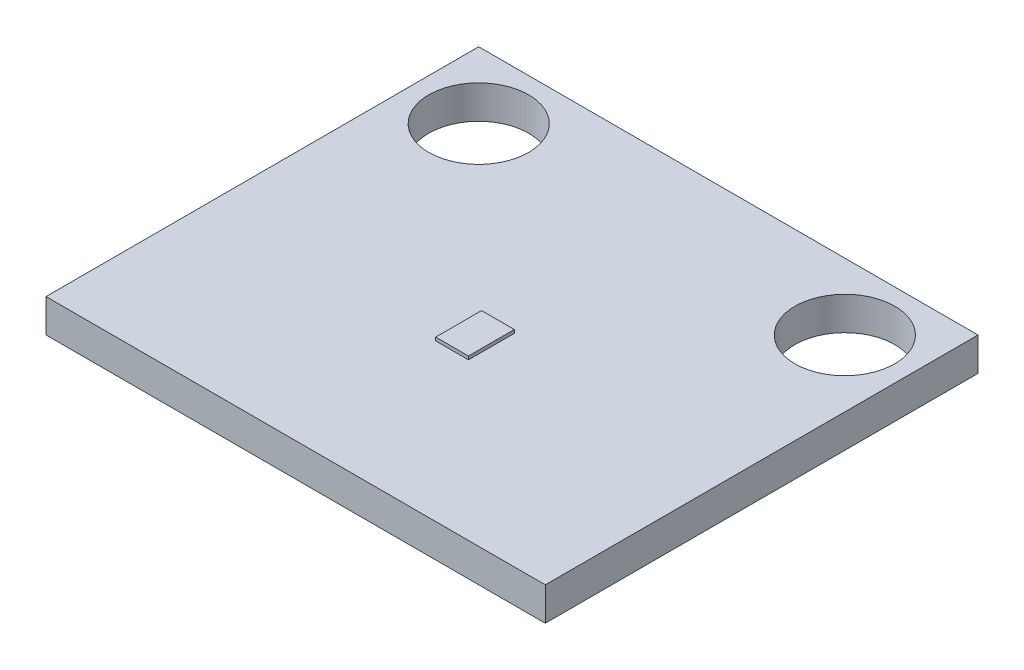
ISO-10303-21;
HEADER;
FILE_DESCRIPTION(('STEP AP214'),'2;1');
FILE_NAME('part.step','',(''),(''),'','','');
FILE_SCHEMA(('AUTOMOTIVE_DESIGN { 1 0 10303 214 1 1 1 1 }'));
ENDSEC;
DATA;
#1=APPLICATION_CONTEXT('core data for automotive mechanical design processes');
#2=APPLICATION_PROTOCOL_DEFINITION('international standard','automotive_design',2000,#1);
#3=PRODUCT_CONTEXT('',#1,'mechanical');
#4=PRODUCT('Part','Part','',(#3));
#5=PRODUCT_RELATED_PRODUCT_CATEGORY('part','',(#4));
#6=PRODUCT_DEFINITION_FORMATION('','',#4);
#7=PRODUCT_DEFINITION_CONTEXT('part definition',#1,'design');
#8=PRODUCT_DEFINITION('design','',#6,#7);
#9=PRODUCT_DEFINITION_SHAPE('','',#8);
#10=(LENGTH_UNIT() NAMED_UNIT(*) SI_UNIT(.MILLI.,.METRE.));
#11=(NAMED_UNIT(*) PLANE_ANGLE_UNIT() SI_UNIT($,.RADIAN.));
#12=(NAMED_UNIT(*) SI_UNIT($,.STERADIAN.) SOLID_ANGLE_UNIT());
#13=UNCERTAINTY_MEASURE_WITH_UNIT(LENGTH_MEASURE(1.E-05),#10,'distance_accuracy_value','');
#14=(GEOMETRIC_REPRESENTATION_CONTEXT(3) GLOBAL_UNCERTAINTY_ASSIGNED_CONTEXT((#13)) GLOBAL_UNIT_ASSIGNED_CONTEXT((#10,
#11,#12)) REPRESENTATION_CONTEXT('',''));
#15=CARTESIAN_POINT('',(0.,0.,0.));
#16=DIRECTION('',(0.,0.,1.));
#17=DIRECTION('',(1.,0.,0.));
#18=AXIS2_PLACEMENT_3D('',#15,#16,#17);
#19=CARTESIAN_POINT('',(0.,1.27,0.));
#20=DIRECTION('',(0.,-1.,0.));
#21=DIRECTION('',(0.,0.,-1.));
#22=AXIS2_PLACEMENT_3D('',#19,#20,#21);
#23=PLANE('',#22);
#24=DIRECTION('',(1.,0.,0.));
#25=VECTOR('',#24,1.);
#26=CARTESIAN_POINT('',(-7.64177142857143,1.27,-7.21722857142857));
#27=LINE('',#26,#25);
#28=CARTESIAN_POINT('',(-7.64177142857143,1.27,-7.21722857142857));
#29=VERTEX_POINT('',#28);
#30=CARTESIAN_POINT('',(11.4082285714286,1.27,-7.21722857142857));
#31=VERTEX_POINT('',#30);
#32=EDGE_CURVE('E141',#29,#31,#27,.T.);
#33=ORIENTED_EDGE('',*,*,#32,.F.);
#34=DIRECTION('',(0.,0.,1.));
#35=VECTOR('',#34,1.);
#36=CARTESIAN_POINT('',(-7.64177142857143,1.27,-7.21722857142857));
#37=LINE('',#36,#35);
#38=CARTESIAN_POINT('',(-7.64177142857143,1.27,9.29277142857143));
#39=VERTEX_POINT('',#38);
#40=EDGE_CURVE('E150',#29,#39,#37,.T.);
#41=ORIENTED_EDGE('',*,*,#40,.T.);
#42=DIRECTION('',(1.,0.,0.));
#43=VECTOR('',#42,1.);
#44=CARTESIAN_POINT('',(-7.64177142857143,1.27,9.29277142857143));
#45=LINE('',#44,#43);
#46=CARTESIAN_POINT('',(11.4082285714286,1.27,9.29277142857143));
#47=VERTEX_POINT('',#46);
#48=EDGE_CURVE('E148',#39,#47,#45,.T.);
#49=ORIENTED_EDGE('',*,*,#48,.T.);
#50=DIRECTION('',(0.,0.,1.));
#51=VECTOR('',#50,1.);
#52=CARTESIAN_POINT('',(11.4082285714286,1.27,-7.21722857142857));
#53=LINE('',#52,#51);
#54=EDGE_CURVE('E144',#31,#47,#53,.T.);
#55=ORIENTED_EDGE('',*,*,#54,.F.);
#56=EDGE_LOOP('',(#33,#41,#49,#55));
#57=FACE_BOUND('',#56,.T.);
#58=CARTESIAN_POINT('',(8.86822857142857,1.27,-4.67722857142858));
#59=DIRECTION('',(0.,1.,0.));
#60=DIRECTION('',(0.,0.,1.));
#61=AXIS2_PLACEMENT_3D('',#58,#59,#60);
#62=CIRCLE('',#61,1.905);
#63=CARTESIAN_POINT('',(8.86822857142857,1.27,-2.77222857142857));
#64=VERTEX_POINT('',#63);
#65=EDGE_CURVE('E123',#64,#64,#62,.T.);
#66=ORIENTED_EDGE('',*,*,#65,.F.);
#67=EDGE_LOOP('',(#66));
#68=FACE_BOUND('',#67,.T.);
#69=CARTESIAN_POINT('',(-5.10177142857143,1.27,-4.67722857142858));
#70=DIRECTION('',(0.,1.,0.));
#71=DIRECTION('',(0.,0.,1.));
#72=AXIS2_PLACEMENT_3D('',#69,#70,#71);
#73=CIRCLE('',#72,1.905);
#74=CARTESIAN_POINT('',(-5.10177142857143,1.27,-2.77222857142858));
#75=VERTEX_POINT('',#74);
#76=EDGE_CURVE('E136',#75,#75,#73,.T.);
#77=ORIENTED_EDGE('',*,*,#76,.F.);
#78=EDGE_LOOP('',(#77));
#79=FACE_BOUND('',#78,.T.);
#80=DIRECTION('',(0.,0.,1.));
#81=VECTOR('',#80,1.);
#82=CARTESIAN_POINT('',(1.25822855142857,1.27,1.57377142857143));
#83=LINE('',#82,#81);
#84=CARTESIAN_POINT('',(1.25822855142857,1.27,1.57377142857143));
#85=VERTEX_POINT('',#84);
#86=CARTESIAN_POINT('',(1.25822855142857,1.27,3.32377142857143));
#87=VERTEX_POINT('',#86);
#88=EDGE_CURVE('E122',#85,#87,#83,.T.);
#89=ORIENTED_EDGE('',*,*,#88,.F.);
#90=DIRECTION('',(-1.,0.,0.));
#91=VECTOR('',#90,1.);
#92=CARTESIAN_POINT('',(1.25822855142857,1.27,1.57377142857143));
#93=LINE('',#92,#91);
#94=CARTESIAN_POINT('',(2.50822859142857,1.27,1.57377142857143));
#95=VERTEX_POINT('',#94);
#96=EDGE_CURVE('E119',#95,#85,#93,.T.);
#97=ORIENTED_EDGE('',*,*,#96,.F.);
#98=DIRECTION('',(0.,0.,-1.));
#99=VECTOR('',#98,1.);
#100=CARTESIAN_POINT('',(2.50822859142857,1.27,1.57377142857143));
#101=LINE('',#100,#99);
#102=CARTESIAN_POINT('',(2.50822859142857,1.27,3.32377142857143));
#103=VERTEX_POINT('',#102);
#104=EDGE_CURVE('E58',#103,#95,#101,.T.);
#105=ORIENTED_EDGE('',*,*,#104,.F.);
#106=DIRECTION('',(1.,0.,0.));
#107=VECTOR('',#106,1.);
#108=CARTESIAN_POINT('',(1.25822855142857,1.27,3.32377142857143));
#109=LINE('',#108,#107);
#110=EDGE_CURVE('E53',#87,#103,#109,.T.);
#111=ORIENTED_EDGE('',*,*,#110,.F.);
#112=EDGE_LOOP('',(#89,#97,#105,#111));
#113=FACE_BOUND('',#112,.T.);
#114=ADVANCED_FACE('F36',(#57,#68,#79,#113),#23,.F.);
#115=CARTESIAN_POINT('',(-7.64177142857143,1.27,-7.21722857142857));
#116=DIRECTION('',(0.,0.,-1.));
#117=DIRECTION('',(-1.,0.,0.));
#118=AXIS2_PLACEMENT_3D('',#115,#116,#117);
#119=PLANE('',#118);
#120=DIRECTION('',(1.,0.,0.));
#121=VECTOR('',#120,1.);
#122=CARTESIAN_POINT('',(-7.64177142857143,0.,-7.21722857142857));
#123=LINE('',#122,#121);
#124=CARTESIAN_POINT('',(-7.64177142857143,0.,-7.21722857142857));
#125=VERTEX_POINT('',#124);
#126=CARTESIAN_POINT('',(11.4082285714286,0.,-7.21722857142857));
#127=VERTEX_POINT('',#126);
#128=EDGE_CURVE('E135',#125,#127,#123,.T.);
#129=ORIENTED_EDGE('',*,*,#128,.F.);
#130=DIRECTION('',(0.,-1.,0.));
#131=VECTOR('',#130,1.);
#132=CARTESIAN_POINT('',(-7.64177142857143,1.27,-7.21722857142857));
#133=LINE('',#132,#131);
#134=EDGE_CURVE('E11',#29,#125,#133,.T.);
#135=ORIENTED_EDGE('',*,*,#134,.F.);
#136=ORIENTED_EDGE('',*,*,#32,.T.);
#137=DIRECTION('',(0.,-1.,0.));
#138=VECTOR('',#137,1.);
#139=CARTESIAN_POINT('',(11.4082285714286,1.27,-7.21722857142857));
#140=LINE('',#139,#138);
#141=EDGE_CURVE('E40',#31,#127,#140,.T.);
#142=ORIENTED_EDGE('',*,*,#141,.T.);
#143=EDGE_LOOP('',(#129,#135,#136,#142));
#144=FACE_BOUND('',#143,.T.);
#145=ADVANCED_FACE('F38',(#144),#119,.T.);
#146=CARTESIAN_POINT('',(-7.64177142857143,1.27,-7.21722857142857));
#147=DIRECTION('',(1.,0.,0.));
#148=DIRECTION('',(0.,0.,-1.));
#149=AXIS2_PLACEMENT_3D('',#146,#147,#148);
#150=PLANE('',#149);
#151=DIRECTION('',(0.,0.,1.));
#152=VECTOR('',#151,1.);
#153=CARTESIAN_POINT('',(-7.64177142857143,0.,-7.21722857142857));
#154=LINE('',#153,#152);
#155=CARTESIAN_POINT('',(-7.64177142857143,0.,9.29277142857143));
#156=VERTEX_POINT('',#155);
#157=EDGE_CURVE('E145',#125,#156,#154,.T.);
#158=ORIENTED_EDGE('',*,*,#157,.T.);
#159=DIRECTION('',(0.,-1.,0.));
#160=VECTOR('',#159,1.);
#161=CARTESIAN_POINT('',(-7.64177142857143,1.27,9.29277142857143));
#162=LINE('',#161,#160);
#163=EDGE_CURVE('E45',#39,#156,#162,.T.);
#164=ORIENTED_EDGE('',*,*,#163,.F.);
#165=ORIENTED_EDGE('',*,*,#40,.F.);
#166=ORIENTED_EDGE('',*,*,#134,.T.);
#167=EDGE_LOOP('',(#158,#164,#165,#166));
#168=FACE_BOUND('',#167,.T.);
#169=ADVANCED_FACE('F177',(#168),#150,.F.);
#170=CARTESIAN_POINT('',(-7.64177142857143,1.27,9.29277142857143));
#171=DIRECTION('',(0.,0.,-1.));
#172=DIRECTION('',(-1.,0.,0.));
#173=AXIS2_PLACEMENT_3D('',#170,#171,#172);
#174=PLANE('',#173);
#175=DIRECTION('',(1.,0.,0.));
#176=VECTOR('',#175,1.);
#177=CARTESIAN_POINT('',(-7.64177142857143,0.,9.29277142857143));
#178=LINE('',#177,#176);
#179=CARTESIAN_POINT('',(11.4082285714286,0.,9.29277142857143));
#180=VERTEX_POINT('',#179);
#181=EDGE_CURVE('E157',#156,#180,#178,.T.);
#182=ORIENTED_EDGE('',*,*,#181,.T.);
#183=DIRECTION('',(0.,-1.,0.));
#184=VECTOR('',#183,1.);
#185=CARTESIAN_POINT('',(11.4082285714286,1.27,9.29277142857143));
#186=LINE('',#185,#184);
#187=EDGE_CURVE('E162',#47,#180,#186,.T.);
#188=ORIENTED_EDGE('',*,*,#187,.F.);
#189=ORIENTED_EDGE('',*,*,#48,.F.);
#190=ORIENTED_EDGE('',*,*,#163,.T.);
#191=EDGE_LOOP('',(#182,#188,#189,#190));
#192=FACE_BOUND('',#191,.T.);
#193=ADVANCED_FACE('F181',(#192),#174,.F.);
#194=CARTESIAN_POINT('',(11.4082285714286,1.27,-7.21722857142857));
#195=DIRECTION('',(1.,0.,0.));
#196=DIRECTION('',(0.,0.,-1.));
#197=AXIS2_PLACEMENT_3D('',#194,#195,#196);
#198=PLANE('',#197);
#199=DIRECTION('',(0.,0.,1.));
#200=VECTOR('',#199,1.);
#201=CARTESIAN_POINT('',(11.4082285714286,0.,-7.21722857142857));
#202=LINE('',#201,#200);
#203=EDGE_CURVE('E154',#127,#180,#202,.T.);
#204=ORIENTED_EDGE('',*,*,#203,.F.);
#205=ORIENTED_EDGE('',*,*,#141,.F.);
#206=ORIENTED_EDGE('',*,*,#54,.T.);
#207=ORIENTED_EDGE('',*,*,#187,.T.);
#208=EDGE_LOOP('',(#204,#205,#206,#207));
#209=FACE_BOUND('',#208,.T.);
#210=ADVANCED_FACE('F170',(#209),#198,.T.);
#211=CARTESIAN_POINT('',(0.,0.,0.));
#212=DIRECTION('',(0.,-1.,0.));
#213=DIRECTION('',(0.,0.,-1.));
#214=AXIS2_PLACEMENT_3D('',#211,#212,#213);
#215=PLANE('',#214);
#216=CARTESIAN_POINT('',(-5.10177142857143,0.,-4.67722857142858));
#217=DIRECTION('',(0.,1.,0.));
#218=DIRECTION('',(0.,0.,1.));
#219=AXIS2_PLACEMENT_3D('',#216,#217,#218);
#220=CIRCLE('',#219,1.905);
#221=CARTESIAN_POINT('',(-5.10177142857143,0.,-2.77222857142858));
#222=VERTEX_POINT('',#221);
#223=EDGE_CURVE('E132',#222,#222,#220,.T.);
#224=ORIENTED_EDGE('',*,*,#223,.T.);
#225=EDGE_LOOP('',(#224));
#226=FACE_BOUND('',#225,.T.);
#227=CARTESIAN_POINT('',(8.86822857142857,0.,-4.67722857142858));
#228=DIRECTION('',(0.,1.,0.));
#229=DIRECTION('',(0.,0.,1.));
#230=AXIS2_PLACEMENT_3D('',#227,#228,#229);
#231=CIRCLE('',#230,1.905);
#232=CARTESIAN_POINT('',(8.86822857142857,0.,-2.77222857142857));
#233=VERTEX_POINT('',#232);
#234=EDGE_CURVE('E126',#233,#233,#231,.T.);
#235=ORIENTED_EDGE('',*,*,#234,.T.);
#236=EDGE_LOOP('',(#235));
#237=FACE_BOUND('',#236,.T.);
#238=ORIENTED_EDGE('',*,*,#128,.T.);
#239=ORIENTED_EDGE('',*,*,#203,.T.);
#240=ORIENTED_EDGE('',*,*,#181,.F.);
#241=ORIENTED_EDGE('',*,*,#157,.F.);
#242=EDGE_LOOP('',(#238,#239,#240,#241));
#243=FACE_BOUND('',#242,.T.);
#244=ADVANCED_FACE('F174',(#226,#237,#243),#215,.T.);
#245=CARTESIAN_POINT('',(8.86822857142857,0.,-4.67722857142858));
#246=DIRECTION('',(0.,1.,0.));
#247=DIRECTION('',(0.,0.,1.));
#248=AXIS2_PLACEMENT_3D('',#245,#246,#247);
#249=CYLINDRICAL_SURFACE('',#248,1.905);
#250=ORIENTED_EDGE('',*,*,#234,.F.);
#251=EDGE_LOOP('',(#250));
#252=FACE_BOUND('',#251,.T.);
#253=ORIENTED_EDGE('',*,*,#65,.T.);
#254=EDGE_LOOP('',(#253));
#255=FACE_BOUND('',#254,.T.);
#256=ADVANCED_FACE('F219',(#252,#255),#249,.F.);
#257=CARTESIAN_POINT('',(-5.10177142857143,0.,-4.67722857142858));
#258=DIRECTION('',(0.,1.,0.));
#259=DIRECTION('',(0.,0.,1.));
#260=AXIS2_PLACEMENT_3D('',#257,#258,#259);
#261=CYLINDRICAL_SURFACE('',#260,1.905);
#262=ORIENTED_EDGE('',*,*,#223,.F.);
#263=EDGE_LOOP('',(#262));
#264=FACE_BOUND('',#263,.T.);
#265=ORIENTED_EDGE('',*,*,#76,.T.);
#266=EDGE_LOOP('',(#265));
#267=FACE_BOUND('',#266,.T.);
#268=ADVANCED_FACE('F216',(#264,#267),#261,.F.);
#269=CARTESIAN_POINT('',(1.25822855142857,1.397,1.57377142857143));
#270=DIRECTION('',(1.,0.,0.));
#271=DIRECTION('',(0.,0.,-1.));
#272=AXIS2_PLACEMENT_3D('',#269,#270,#271);
#273=PLANE('',#272);
#274=ORIENTED_EDGE('',*,*,#88,.T.);
#275=DIRECTION('',(0.,-1.,0.));
#276=VECTOR('',#275,1.);
#277=CARTESIAN_POINT('',(1.25822855142857,1.397,3.32377142857143));
#278=LINE('',#277,#276);
#279=CARTESIAN_POINT('',(1.25822855142857,1.397,3.32377142857143));
#280=VERTEX_POINT('',#279);
#281=EDGE_CURVE('E103',#280,#87,#278,.T.);
#282=ORIENTED_EDGE('',*,*,#281,.F.);
#283=DIRECTION('',(0.,0.,1.));
#284=VECTOR('',#283,1.);
#285=CARTESIAN_POINT('',(1.25822855142857,1.397,1.57377142857143));
#286=LINE('',#285,#284);
#287=CARTESIAN_POINT('',(1.25822855142857,1.397,1.57377142857143));
#288=VERTEX_POINT('',#287);
#289=EDGE_CURVE('E110',#288,#280,#286,.T.);
#290=ORIENTED_EDGE('',*,*,#289,.F.);
#291=DIRECTION('',(0.,-1.,0.));
#292=VECTOR('',#291,1.);
#293=CARTESIAN_POINT('',(1.25822855142857,1.397,1.57377142857143));
#294=LINE('',#293,#292);
#295=EDGE_CURVE('E194',#288,#85,#294,.T.);
#296=ORIENTED_EDGE('',*,*,#295,.T.);
#297=EDGE_LOOP('',(#274,#282,#290,#296));
#298=FACE_BOUND('',#297,.T.);
#299=ADVANCED_FACE('F121',(#298),#273,.F.);
#300=CARTESIAN_POINT('',(1.25822855142857,1.397,3.32377142857143));
#301=DIRECTION('',(0.,0.,-1.));
#302=DIRECTION('',(-1.,0.,0.));
#303=AXIS2_PLACEMENT_3D('',#300,#301,#302);
#304=PLANE('',#303);
#305=ORIENTED_EDGE('',*,*,#110,.T.);
#306=DIRECTION('',(0.,-1.,0.));
#307=VECTOR('',#306,1.);
#308=CARTESIAN_POINT('',(2.50822859142857,1.397,3.32377142857143));
#309=LINE('',#308,#307);
#310=CARTESIAN_POINT('',(2.50822859142857,1.397,3.32377142857143));
#311=VERTEX_POINT('',#310);
#312=EDGE_CURVE('E106',#311,#103,#309,.T.);
#313=ORIENTED_EDGE('',*,*,#312,.F.);
#314=DIRECTION('',(1.,0.,0.));
#315=VECTOR('',#314,1.);
#316=CARTESIAN_POINT('',(1.25822855142857,1.397,3.32377142857143));
#317=LINE('',#316,#315);
#318=EDGE_CURVE('E99',#280,#311,#317,.T.);
#319=ORIENTED_EDGE('',*,*,#318,.F.);
#320=ORIENTED_EDGE('',*,*,#281,.T.);
#321=EDGE_LOOP('',(#305,#313,#319,#320));
#322=FACE_BOUND('',#321,.T.);
#323=ADVANCED_FACE('F101',(#322),#304,.F.);
#324=CARTESIAN_POINT('',(2.50822859142857,1.397,1.57377142857143));
#325=DIRECTION('',(-1.,0.,0.));
#326=DIRECTION('',(0.,0.,1.));
#327=AXIS2_PLACEMENT_3D('',#324,#325,#326);
#328=PLANE('',#327);
#329=ORIENTED_EDGE('',*,*,#104,.T.);
#330=DIRECTION('',(0.,-1.,0.));
#331=VECTOR('',#330,1.);
#332=CARTESIAN_POINT('',(2.50822859142857,1.397,1.57377142857143));
#333=LINE('',#332,#331);
#334=CARTESIAN_POINT('',(2.50822859142857,1.397,1.57377142857143));
#335=VERTEX_POINT('',#334);
#336=EDGE_CURVE('E128',#335,#95,#333,.T.);
#337=ORIENTED_EDGE('',*,*,#336,.F.);
#338=DIRECTION('',(0.,0.,-1.));
#339=VECTOR('',#338,1.);
#340=CARTESIAN_POINT('',(2.50822859142857,1.397,1.57377142857143));
#341=LINE('',#340,#339);
#342=EDGE_CURVE('E109',#311,#335,#341,.T.);
#343=ORIENTED_EDGE('',*,*,#342,.F.);
#344=ORIENTED_EDGE('',*,*,#312,.T.);
#345=EDGE_LOOP('',(#329,#337,#343,#344));
#346=FACE_BOUND('',#345,.T.);
#347=ADVANCED_FACE('F203',(#346),#328,.F.);
#348=CARTESIAN_POINT('',(1.25822855142857,1.397,1.57377142857143));
#349=DIRECTION('',(0.,0.,1.));
#350=DIRECTION('',(1.,0.,0.));
#351=AXIS2_PLACEMENT_3D('',#348,#349,#350);
#352=PLANE('',#351);
#353=ORIENTED_EDGE('',*,*,#96,.T.);
#354=ORIENTED_EDGE('',*,*,#295,.F.);
#355=DIRECTION('',(-1.,0.,0.));
#356=VECTOR('',#355,1.);
#357=CARTESIAN_POINT('',(1.25822855142857,1.397,1.57377142857143));
#358=LINE('',#357,#356);
#359=EDGE_CURVE('E115',#335,#288,#358,.T.);
#360=ORIENTED_EDGE('',*,*,#359,.F.);
#361=ORIENTED_EDGE('',*,*,#336,.T.);
#362=EDGE_LOOP('',(#353,#354,#360,#361));
#363=FACE_BOUND('',#362,.T.);
#364=ADVANCED_FACE('F193',(#363),#352,.F.);
#365=CARTESIAN_POINT('',(0.,1.397,0.));
#366=DIRECTION('',(0.,1.,0.));
#367=DIRECTION('',(0.,0.,1.));
#368=AXIS2_PLACEMENT_3D('',#365,#366,#367);
#369=PLANE('',#368);
#370=ORIENTED_EDGE('',*,*,#289,.T.);
#371=ORIENTED_EDGE('',*,*,#318,.T.);
#372=ORIENTED_EDGE('',*,*,#342,.T.);
#373=ORIENTED_EDGE('',*,*,#359,.T.);
#374=EDGE_LOOP('',(#370,#371,#372,#373));
#375=FACE_BOUND('',#374,.T.);
#376=ADVANCED_FACE('F113',(#375),#369,.T.);
#377=CLOSED_SHELL('',(#114,#145,#169,#193,#210,#244,#256,#268,#299,#323,#347,#364,#376));
#378=MANIFOLD_SOLID_BREP('B2',#377);
#379=ADVANCED_BREP_SHAPE_REPRESENTATION('',(#18,#378),#14);
#380=SHAPE_DEFINITION_REPRESENTATION(#9,#379);
ENDSEC;
END-ISO-10303-21;
